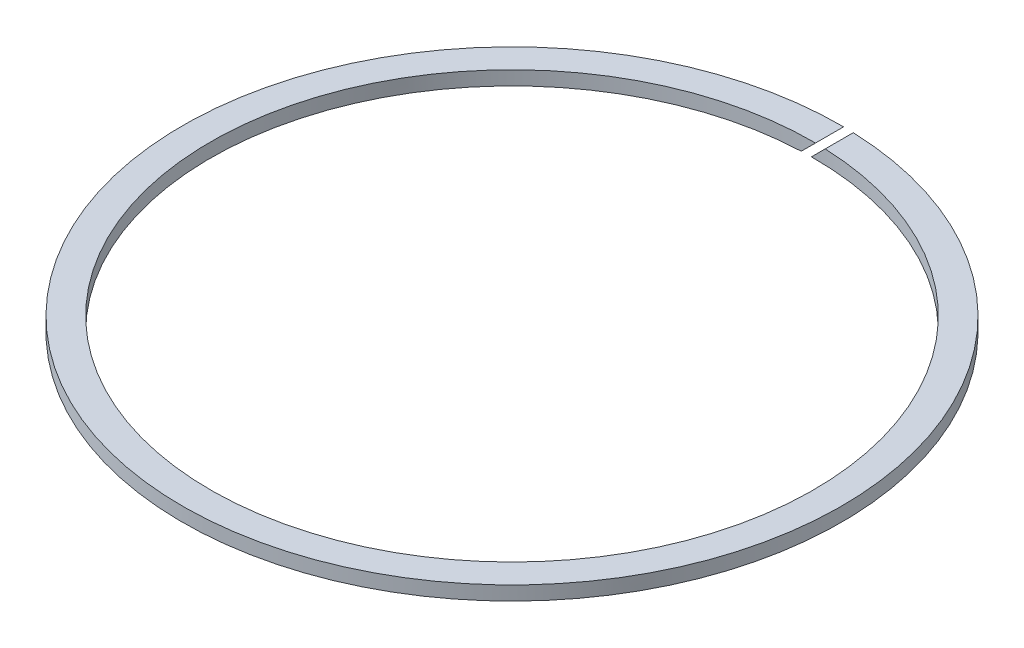
ISO-10303-21;
HEADER;
FILE_DESCRIPTION(('STEP AP214'),'2;1');
FILE_NAME('part.step','',(''),(''),'','','');
FILE_SCHEMA(('AUTOMOTIVE_DESIGN { 1 0 10303 214 1 1 1 1 }'));
ENDSEC;
DATA;
#1=APPLICATION_CONTEXT('core data for automotive mechanical design processes');
#2=APPLICATION_PROTOCOL_DEFINITION('international standard','automotive_design',2000,#1);
#3=PRODUCT_CONTEXT('',#1,'mechanical');
#4=PRODUCT('Part','Part','',(#3));
#5=PRODUCT_RELATED_PRODUCT_CATEGORY('part','',(#4));
#6=PRODUCT_DEFINITION_FORMATION('','',#4);
#7=PRODUCT_DEFINITION_CONTEXT('part definition',#1,'design');
#8=PRODUCT_DEFINITION('design','',#6,#7);
#9=PRODUCT_DEFINITION_SHAPE('','',#8);
#10=(LENGTH_UNIT() NAMED_UNIT(*) SI_UNIT(.MILLI.,.METRE.));
#11=(NAMED_UNIT(*) PLANE_ANGLE_UNIT() SI_UNIT($,.RADIAN.));
#12=(NAMED_UNIT(*) SI_UNIT($,.STERADIAN.) SOLID_ANGLE_UNIT());
#13=UNCERTAINTY_MEASURE_WITH_UNIT(LENGTH_MEASURE(1.E-05),#10,'distance_accuracy_value','');
#14=(GEOMETRIC_REPRESENTATION_CONTEXT(3) GLOBAL_UNCERTAINTY_ASSIGNED_CONTEXT((#13)) GLOBAL_UNIT_ASSIGNED_CONTEXT((#10,
#11,#12)) REPRESENTATION_CONTEXT('',''));
#15=CARTESIAN_POINT('',(0.,0.,0.));
#16=DIRECTION('',(0.,0.,1.));
#17=DIRECTION('',(1.,0.,0.));
#18=AXIS2_PLACEMENT_3D('',#15,#16,#17);
#19=CARTESIAN_POINT('',(0.,1.,0.));
#20=DIRECTION('',(0.,1.,0.));
#21=DIRECTION('',(0.,0.,1.));
#22=AXIS2_PLACEMENT_3D('',#19,#20,#21);
#23=PLANE('',#22);
#24=DIRECTION('',(0.,0.,1.));
#25=VECTOR('',#24,1.);
#26=CARTESIAN_POINT('',(0.292893218812662,1.,0.));
#27=LINE('',#26,#25);
#28=CARTESIAN_POINT('',(0.292893218812662,1.,-46.9990873694625));
#29=VERTEX_POINT('',#28);
#30=CARTESIAN_POINT('',(0.292893218812662,1.,-42.9990024717129));
#31=VERTEX_POINT('',#30);
#32=EDGE_CURVE('E62',#29,#31,#27,.T.);
#33=ORIENTED_EDGE('',*,*,#32,.F.);
#34=CARTESIAN_POINT('',(0.,1.,0.));
#35=DIRECTION('',(0.,1.,0.));
#36=DIRECTION('',(0.,0.,1.));
#37=AXIS2_PLACEMENT_3D('',#34,#35,#36);
#38=CIRCLE('',#37,47.);
#39=CARTESIAN_POINT('',(1.70710678118577,1.,-46.9689874964069));
#40=VERTEX_POINT('',#39);
#41=EDGE_CURVE('E87',#29,#40,#38,.T.);
#42=ORIENTED_EDGE('',*,*,#41,.T.);
#43=DIRECTION('',(0.,0.,-1.));
#44=VECTOR('',#43,1.);
#45=CARTESIAN_POINT('',(1.70710678118577,1.,0.));
#46=LINE('',#45,#44);
#47=CARTESIAN_POINT('',(1.70710678118577,1.,-42.9661004332209));
#48=VERTEX_POINT('',#47);
#49=EDGE_CURVE('E80',#48,#40,#46,.T.);
#50=ORIENTED_EDGE('',*,*,#49,.F.);
#51=CARTESIAN_POINT('',(0.,1.,0.));
#52=DIRECTION('',(0.,1.,0.));
#53=DIRECTION('',(0.,0.,1.));
#54=AXIS2_PLACEMENT_3D('',#51,#52,#53);
#55=CIRCLE('',#54,43.);
#56=EDGE_CURVE('E90',#31,#48,#55,.T.);
#57=ORIENTED_EDGE('',*,*,#56,.F.);
#58=EDGE_LOOP('',(#33,#42,#50,#57));
#59=FACE_BOUND('',#58,.T.);
#60=ADVANCED_FACE('F39',(#59),#23,.T.);
#61=CARTESIAN_POINT('',(0.,-1.,0.));
#62=DIRECTION('',(0.,1.,0.));
#63=DIRECTION('',(0.,0.,1.));
#64=AXIS2_PLACEMENT_3D('',#61,#62,#63);
#65=PLANE('',#64);
#66=CARTESIAN_POINT('',(0.,-1.,0.));
#67=DIRECTION('',(0.,1.,0.));
#68=DIRECTION('',(0.,0.,1.));
#69=AXIS2_PLACEMENT_3D('',#66,#67,#68);
#70=CIRCLE('',#69,47.);
#71=CARTESIAN_POINT('',(-1.70710678118736,-1.,-46.9689874964069));
#72=VERTEX_POINT('',#71);
#73=CARTESIAN_POINT('',(-0.292893218814257,-1.,-46.9990873694625));
#74=VERTEX_POINT('',#73);
#75=EDGE_CURVE('E97',#72,#74,#70,.T.);
#76=ORIENTED_EDGE('',*,*,#75,.F.);
#77=DIRECTION('',(0.,0.,1.));
#78=VECTOR('',#77,1.);
#79=CARTESIAN_POINT('',(-1.70710678118736,-1.,0.));
#80=LINE('',#79,#78);
#81=CARTESIAN_POINT('',(-1.70710678118736,-1.,-42.9661004332209));
#82=VERTEX_POINT('',#81);
#83=EDGE_CURVE('E113',#72,#82,#80,.T.);
#84=ORIENTED_EDGE('',*,*,#83,.T.);
#85=CARTESIAN_POINT('',(0.,-1.,0.));
#86=DIRECTION('',(0.,1.,0.));
#87=DIRECTION('',(0.,0.,1.));
#88=AXIS2_PLACEMENT_3D('',#85,#86,#87);
#89=CIRCLE('',#88,43.);
#90=CARTESIAN_POINT('',(-0.292893218814256,-1.,-42.9990024717129));
#91=VERTEX_POINT('',#90);
#92=EDGE_CURVE('E98',#82,#91,#89,.T.);
#93=ORIENTED_EDGE('',*,*,#92,.T.);
#94=DIRECTION('',(0.,0.,-1.));
#95=VECTOR('',#94,1.);
#96=CARTESIAN_POINT('',(-0.292893218814257,-1.,0.));
#97=LINE('',#96,#95);
#98=EDGE_CURVE('E55',#91,#74,#97,.T.);
#99=ORIENTED_EDGE('',*,*,#98,.T.);
#100=EDGE_LOOP('',(#76,#84,#93,#99));
#101=FACE_BOUND('',#100,.T.);
#102=ADVANCED_FACE('F122',(#101),#65,.F.);
#103=CARTESIAN_POINT('',(0.,1.,0.));
#104=DIRECTION('',(0.,-1.,0.));
#105=DIRECTION('',(0.,0.,-1.));
#106=AXIS2_PLACEMENT_3D('',#103,#104,#105);
#107=CYLINDRICAL_SURFACE('',#106,47.);
#108=ORIENTED_EDGE('',*,*,#41,.F.);
#109=CARTESIAN_POINT('',(0.,0.707106781187341,0.));
#110=DIRECTION('',(-0.707106781186544,0.707106781186551,0.));
#111=DIRECTION('',(-0.707106781186551,-0.707106781186544,0.));
#112=AXIS2_PLACEMENT_3D('',#109,#110,#111);
#113=ELLIPSE('',#112,66.4680374315351,47.);
#114=EDGE_CURVE('E104',#29,#72,#113,.T.);
#115=ORIENTED_EDGE('',*,*,#114,.T.);
#116=ORIENTED_EDGE('',*,*,#75,.T.);
#117=CARTESIAN_POINT('',(0.,-0.707106781185748,0.));
#118=DIRECTION('',(0.707106781186544,-0.707106781186551,0.));
#119=DIRECTION('',(-0.707106781186551,-0.707106781186544,0.));
#120=AXIS2_PLACEMENT_3D('',#117,#118,#119);
#121=ELLIPSE('',#120,66.4680374315351,47.);
#122=EDGE_CURVE('E93',#74,#40,#121,.T.);
#123=ORIENTED_EDGE('',*,*,#122,.T.);
#124=EDGE_LOOP('',(#108,#115,#116,#123));
#125=FACE_BOUND('',#124,.T.);
#126=ADVANCED_FACE('F41',(#125),#107,.T.);
#127=CARTESIAN_POINT('',(0.,1.,0.));
#128=DIRECTION('',(0.,-1.,0.));
#129=DIRECTION('',(0.,0.,-1.));
#130=AXIS2_PLACEMENT_3D('',#127,#128,#129);
#131=CYLINDRICAL_SURFACE('',#130,43.);
#132=CARTESIAN_POINT('',(0.,0.707106781187341,0.));
#133=DIRECTION('',(-0.707106781186544,0.707106781186551,0.));
#134=DIRECTION('',(-0.707106781186551,-0.707106781186544,0.));
#135=AXIS2_PLACEMENT_3D('',#132,#133,#134);
#136=ELLIPSE('',#135,60.8111831820427,43.);
#137=EDGE_CURVE('E11',#31,#82,#136,.T.);
#138=ORIENTED_EDGE('',*,*,#137,.F.);
#139=ORIENTED_EDGE('',*,*,#56,.T.);
#140=CARTESIAN_POINT('',(0.,-0.707106781185748,0.));
#141=DIRECTION('',(0.707106781186544,-0.707106781186551,0.));
#142=DIRECTION('',(-0.707106781186551,-0.707106781186544,0.));
#143=AXIS2_PLACEMENT_3D('',#140,#141,#142);
#144=ELLIPSE('',#143,60.8111831820427,43.);
#145=EDGE_CURVE('E48',#91,#48,#144,.T.);
#146=ORIENTED_EDGE('',*,*,#145,.F.);
#147=ORIENTED_EDGE('',*,*,#92,.F.);
#148=EDGE_LOOP('',(#138,#139,#146,#147));
#149=FACE_BOUND('',#148,.T.);
#150=ADVANCED_FACE('F95',(#149),#131,.F.);
#151=CARTESIAN_POINT('',(-6.71751442127264,-7.42462120245832,-47.));
#152=DIRECTION('',(0.707106781186544,-0.707106781186551,0.));
#153=DIRECTION('',(0.707106781186551,0.707106781186544,0.));
#154=AXIS2_PLACEMENT_3D('',#151,#152,#153);
#155=PLANE('',#154);
#156=ORIENTED_EDGE('',*,*,#98,.F.);
#157=ORIENTED_EDGE('',*,*,#145,.T.);
#158=ORIENTED_EDGE('',*,*,#49,.T.);
#159=ORIENTED_EDGE('',*,*,#122,.F.);
#160=EDGE_LOOP('',(#156,#157,#158,#159));
#161=FACE_BOUND('',#160,.T.);
#162=ADVANCED_FACE('F79',(#161),#155,.F.);
#163=CARTESIAN_POINT('',(-7.42462120245919,-6.71751442127176,-47.));
#164=DIRECTION('',(-0.707106781186544,0.707106781186551,0.));
#165=DIRECTION('',(-0.707106781186551,-0.707106781186544,0.));
#166=AXIS2_PLACEMENT_3D('',#163,#164,#165);
#167=PLANE('',#166);
#168=ORIENTED_EDGE('',*,*,#32,.T.);
#169=ORIENTED_EDGE('',*,*,#137,.T.);
#170=ORIENTED_EDGE('',*,*,#83,.F.);
#171=ORIENTED_EDGE('',*,*,#114,.F.);
#172=EDGE_LOOP('',(#168,#169,#170,#171));
#173=FACE_BOUND('',#172,.T.);
#174=ADVANCED_FACE('F125',(#173),#167,.F.);
#175=CLOSED_SHELL('',(#60,#102,#126,#150,#162,#174));
#176=MANIFOLD_SOLID_BREP('B2',#175);
#177=ADVANCED_BREP_SHAPE_REPRESENTATION('',(#18,#176),#14);
#178=SHAPE_DEFINITION_REPRESENTATION(#9,#177);
ENDSEC;
END-ISO-10303-21;
